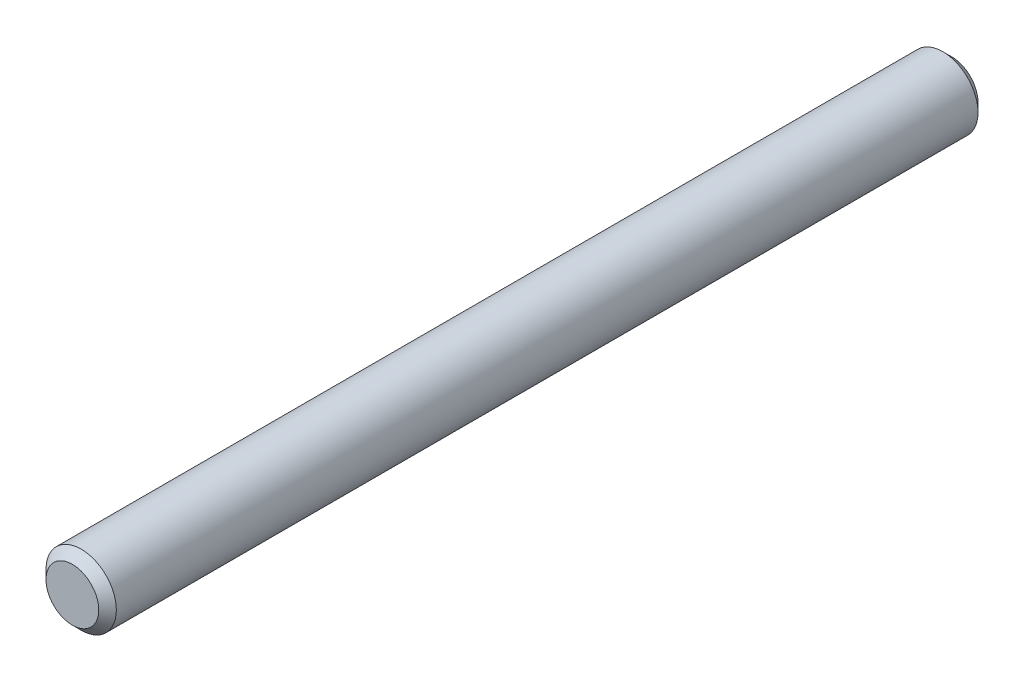
ISO-10303-21;
HEADER;
FILE_DESCRIPTION(('STEP AP214'),'2;1');
FILE_NAME('part.step','',(''),(''),'','','');
FILE_SCHEMA(('AUTOMOTIVE_DESIGN { 1 0 10303 214 1 1 1 1 }'));
ENDSEC;
DATA;
#1=APPLICATION_CONTEXT('core data for automotive mechanical design processes');
#2=APPLICATION_PROTOCOL_DEFINITION('international standard','automotive_design',2000,#1);
#3=PRODUCT_CONTEXT('',#1,'mechanical');
#4=PRODUCT('Part','Part','',(#3));
#5=PRODUCT_RELATED_PRODUCT_CATEGORY('part','',(#4));
#6=PRODUCT_DEFINITION_FORMATION('','',#4);
#7=PRODUCT_DEFINITION_CONTEXT('part definition',#1,'design');
#8=PRODUCT_DEFINITION('design','',#6,#7);
#9=PRODUCT_DEFINITION_SHAPE('','',#8);
#10=(LENGTH_UNIT() NAMED_UNIT(*) SI_UNIT(.MILLI.,.METRE.));
#11=(NAMED_UNIT(*) PLANE_ANGLE_UNIT() SI_UNIT($,.RADIAN.));
#12=(NAMED_UNIT(*) SI_UNIT($,.STERADIAN.) SOLID_ANGLE_UNIT());
#13=UNCERTAINTY_MEASURE_WITH_UNIT(LENGTH_MEASURE(1.E-05),#10,'distance_accuracy_value','');
#14=(GEOMETRIC_REPRESENTATION_CONTEXT(3) GLOBAL_UNCERTAINTY_ASSIGNED_CONTEXT((#13)) GLOBAL_UNIT_ASSIGNED_CONTEXT((#10,
#11,#12)) REPRESENTATION_CONTEXT('',''));
#15=CARTESIAN_POINT('',(0.,0.,0.));
#16=DIRECTION('',(0.,0.,1.));
#17=DIRECTION('',(1.,0.,0.));
#18=AXIS2_PLACEMENT_3D('',#15,#16,#17);
#19=CARTESIAN_POINT('',(0.,0.,25.));
#20=DIRECTION('',(0.,0.,-1.));
#21=DIRECTION('',(-1.,0.,0.));
#22=AXIS2_PLACEMENT_3D('',#19,#20,#21);
#23=CYLINDRICAL_SURFACE('',#22,2.);
#24=CARTESIAN_POINT('',(0.,0.,-24.5));
#25=DIRECTION('',(0.,0.,1.));
#26=DIRECTION('',(1.,0.,0.));
#27=AXIS2_PLACEMENT_3D('',#24,#25,#26);
#28=CIRCLE('',#27,2.);
#29=CARTESIAN_POINT('',(2.,0.,-24.5));
#30=VERTEX_POINT('',#29);
#31=EDGE_CURVE('E27',#30,#30,#28,.T.);
#32=ORIENTED_EDGE('',*,*,#31,.T.);
#33=EDGE_LOOP('',(#32));
#34=FACE_BOUND('',#33,.T.);
#35=CARTESIAN_POINT('',(0.,0.,24.5));
#36=DIRECTION('',(0.,0.,1.));
#37=DIRECTION('',(1.,0.,0.));
#38=AXIS2_PLACEMENT_3D('',#35,#36,#37);
#39=CIRCLE('',#38,2.);
#40=CARTESIAN_POINT('',(2.,0.,24.5));
#41=VERTEX_POINT('',#40);
#42=EDGE_CURVE('E31',#41,#41,#39,.F.);
#43=ORIENTED_EDGE('',*,*,#42,.T.);
#44=EDGE_LOOP('',(#43));
#45=FACE_BOUND('',#44,.T.);
#46=ADVANCED_FACE('F15',(#34,#45),#23,.T.);
#47=CARTESIAN_POINT('',(0.,0.,25.));
#48=DIRECTION('',(0.,0.,1.));
#49=DIRECTION('',(1.,0.,0.));
#50=AXIS2_PLACEMENT_3D('',#47,#48,#49);
#51=PLANE('',#50);
#52=CARTESIAN_POINT('',(0.,0.,25.));
#53=DIRECTION('',(0.,0.,1.));
#54=DIRECTION('',(1.,0.,0.));
#55=AXIS2_PLACEMENT_3D('',#52,#53,#54);
#56=CIRCLE('',#55,1.5);
#57=CARTESIAN_POINT('',(1.5,0.,25.));
#58=VERTEX_POINT('',#57);
#59=EDGE_CURVE('E10',#58,#58,#56,.T.);
#60=ORIENTED_EDGE('',*,*,#59,.T.);
#61=EDGE_LOOP('',(#60));
#62=FACE_BOUND('',#61,.T.);
#63=ADVANCED_FACE('F49',(#62),#51,.T.);
#64=CARTESIAN_POINT('',(0.,0.,-25.));
#65=DIRECTION('',(0.,0.,1.));
#66=DIRECTION('',(1.,0.,0.));
#67=AXIS2_PLACEMENT_3D('',#64,#65,#66);
#68=PLANE('',#67);
#69=CARTESIAN_POINT('',(0.,0.,-25.));
#70=DIRECTION('',(0.,0.,1.));
#71=DIRECTION('',(1.,0.,0.));
#72=AXIS2_PLACEMENT_3D('',#69,#70,#71);
#73=CIRCLE('',#72,1.49999999999999);
#74=CARTESIAN_POINT('',(1.49999999999999,0.,-25.));
#75=VERTEX_POINT('',#74);
#76=EDGE_CURVE('E23',#75,#75,#73,.F.);
#77=ORIENTED_EDGE('',*,*,#76,.T.);
#78=EDGE_LOOP('',(#77));
#79=FACE_BOUND('',#78,.T.);
#80=ADVANCED_FACE('F46',(#79),#68,.F.);
#81=CARTESIAN_POINT('',(0.,0.,-24.5));
#82=DIRECTION('',(0.,0.,1.));
#83=DIRECTION('',(1.,0.,0.));
#84=AXIS2_PLACEMENT_3D('',#81,#82,#83);
#85=CONICAL_SURFACE('',#84,2.,0.785398163397453);
#86=ORIENTED_EDGE('',*,*,#76,.F.);
#87=EDGE_LOOP('',(#86));
#88=FACE_BOUND('',#87,.T.);
#89=ORIENTED_EDGE('',*,*,#31,.F.);
#90=EDGE_LOOP('',(#89));
#91=FACE_BOUND('',#90,.T.);
#92=ADVANCED_FACE('F40',(#88,#91),#85,.T.);
#93=CARTESIAN_POINT('',(0.,0.,25.));
#94=DIRECTION('',(0.,0.,-1.));
#95=DIRECTION('',(-1.,0.,0.));
#96=AXIS2_PLACEMENT_3D('',#93,#94,#95);
#97=CONICAL_SURFACE('',#96,1.5,0.785398163397439);
#98=ORIENTED_EDGE('',*,*,#42,.F.);
#99=EDGE_LOOP('',(#98));
#100=FACE_BOUND('',#99,.T.);
#101=ORIENTED_EDGE('',*,*,#59,.F.);
#102=EDGE_LOOP('',(#101));
#103=FACE_BOUND('',#102,.T.);
#104=ADVANCED_FACE('F18',(#100,#103),#97,.T.);
#105=CLOSED_SHELL('',(#46,#63,#80,#92,#104));
#106=MANIFOLD_SOLID_BREP('B1',#105);
#107=ADVANCED_BREP_SHAPE_REPRESENTATION('',(#18,#106),#14);
#108=SHAPE_DEFINITION_REPRESENTATION(#9,#107);
ENDSEC;
END-ISO-10303-21;
